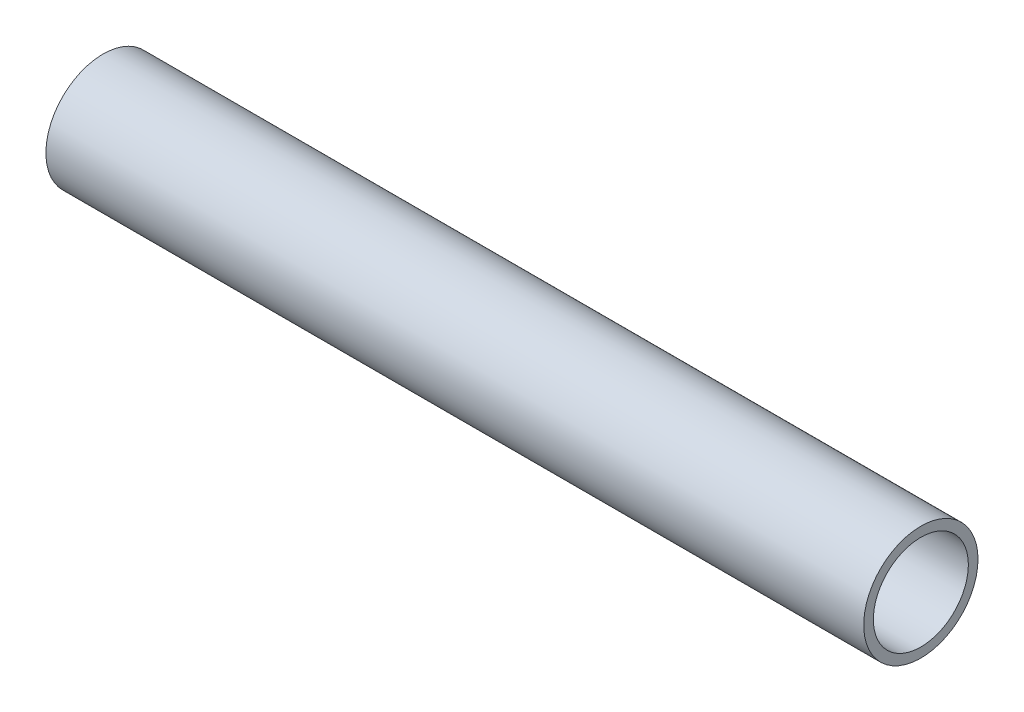
ISO-10303-21;
HEADER;
FILE_DESCRIPTION(('STEP AP214'),'2;1');
FILE_NAME('part.step','',(''),(''),'','','');
FILE_SCHEMA(('AUTOMOTIVE_DESIGN { 1 0 10303 214 1 1 1 1 }'));
ENDSEC;
DATA;
#1=APPLICATION_CONTEXT('core data for automotive mechanical design processes');
#2=APPLICATION_PROTOCOL_DEFINITION('international standard','automotive_design',2000,#1);
#3=PRODUCT_CONTEXT('',#1,'mechanical');
#4=PRODUCT('Part','Part','',(#3));
#5=PRODUCT_RELATED_PRODUCT_CATEGORY('part','',(#4));
#6=PRODUCT_DEFINITION_FORMATION('','',#4);
#7=PRODUCT_DEFINITION_CONTEXT('part definition',#1,'design');
#8=PRODUCT_DEFINITION('design','',#6,#7);
#9=PRODUCT_DEFINITION_SHAPE('','',#8);
#10=(LENGTH_UNIT() NAMED_UNIT(*) SI_UNIT(.MILLI.,.METRE.));
#11=(NAMED_UNIT(*) PLANE_ANGLE_UNIT() SI_UNIT($,.RADIAN.));
#12=(NAMED_UNIT(*) SI_UNIT($,.STERADIAN.) SOLID_ANGLE_UNIT());
#13=UNCERTAINTY_MEASURE_WITH_UNIT(LENGTH_MEASURE(1.E-05),#10,'distance_accuracy_value','');
#14=(GEOMETRIC_REPRESENTATION_CONTEXT(3) GLOBAL_UNCERTAINTY_ASSIGNED_CONTEXT((#13)) GLOBAL_UNIT_ASSIGNED_CONTEXT((#10,
#11,#12)) REPRESENTATION_CONTEXT('',''));
#15=CARTESIAN_POINT('',(0.,0.,0.));
#16=DIRECTION('',(0.,0.,1.));
#17=DIRECTION('',(1.,0.,0.));
#18=AXIS2_PLACEMENT_3D('',#15,#16,#17);
#19=CARTESIAN_POINT('',(-174.625,0.,0.));
#20=DIRECTION('',(1.,0.,0.));
#21=DIRECTION('',(0.,0.,-1.));
#22=AXIS2_PLACEMENT_3D('',#19,#20,#21);
#23=CYLINDRICAL_SURFACE('',#22,21.082);
#24=CARTESIAN_POINT('',(-95.25,0.,-21.082));
#25=CARTESIAN_POINT('',(-95.2500073037573,-0.177265588906064,-21.0819971511082));
#26=CARTESIAN_POINT('',(-95.2648956722781,-0.354633825443564,-21.0797407978607));
#27=CARTESIAN_POINT('',(-95.3240403602155,-0.704412011201185,-21.0709569196678));
#28=CARTESIAN_POINT('',(-95.3683252199961,-0.876816971803983,-21.064425243998));
#29=CARTESIAN_POINT('',(-95.4849091388346,-1.21155604974819,-21.0478246855302));
#30=CARTESIAN_POINT('',(-95.5571869641717,-1.37389769247853,-21.0377584843423));
#31=CARTESIAN_POINT('',(-95.7276530975323,-1.68412370373539,-21.0152009969064));
#32=CARTESIAN_POINT('',(-95.8258378289602,-1.83201006403648,-21.0027100454717));
#33=CARTESIAN_POINT('',(-96.0461542058056,-2.1103164343508,-20.9765819826565));
#34=CARTESIAN_POINT('',(-96.1684495601003,-2.24060616148058,-20.9629374218632));
#35=CARTESIAN_POINT('',(-96.4331633864275,-2.47889671955908,-20.9360982303561));
#36=CARTESIAN_POINT('',(-96.5755830188655,-2.58689626432783,-20.9229036256421));
#37=CARTESIAN_POINT('',(-96.8773786544134,-2.77804840978028,-20.8983859912104));
#38=CARTESIAN_POINT('',(-97.0368354067939,-2.86107486347092,-20.8870725883659));
#39=CARTESIAN_POINT('',(-97.3676295731584,-2.99911783525677,-20.8677000439257));
#40=CARTESIAN_POINT('',(-97.5389663337644,-3.05413589237424,-20.8596407235276));
#41=CARTESIAN_POINT('',(-97.8872863628436,-3.13419550245968,-20.8477621012251));
#42=CARTESIAN_POINT('',(-98.0642172558634,-3.15946016290709,-20.8439112577396));
#43=CARTESIAN_POINT('',(-98.419845943067,-3.17998699422211,-20.8407898425614));
#44=CARTESIAN_POINT('',(-98.5985436343971,-3.17525090142445,-20.8415190057945));
#45=CARTESIAN_POINT('',(-98.9510567099515,-3.13609297404926,-20.8474463775802));
#46=CARTESIAN_POINT('',(-99.1249004248299,-3.101919701057,-20.852607165254));
#47=CARTESIAN_POINT('',(-99.4643579756068,-3.00524659900985,-20.8667578327125));
#48=CARTESIAN_POINT('',(-99.6299715768266,-2.94274596272441,-20.8757478216156));
#49=CARTESIAN_POINT('',(-99.9490235812398,-2.7909340011809,-20.8965852461813));
#50=CARTESIAN_POINT('',(-100.102411162019,-2.70151746318004,-20.9084438587404));
#51=CARTESIAN_POINT('',(-100.392099144084,-2.498486828096,-20.9336742925736));
#52=CARTESIAN_POINT('',(-100.528398414064,-2.38487113028628,-20.9470462139227));
#53=CARTESIAN_POINT('',(-100.781481243325,-2.1353032656861,-20.9739618878806));
#54=CARTESIAN_POINT('',(-100.898054144489,-1.9991374095518,-20.9875060134767));
#55=CARTESIAN_POINT('',(-101.106725455512,-1.70906259522473,-21.0131148002247));
#56=CARTESIAN_POINT('',(-101.198823756631,-1.55515355820368,-21.0251794548033));
#57=CARTESIAN_POINT('',(-101.355942659601,-1.23377816277264,-21.0464826923882));
#58=CARTESIAN_POINT('',(-101.420946926471,-1.06630369822491,-21.0557195696406));
#59=CARTESIAN_POINT('',(-101.521848958346,-0.722645240857131,-21.070312259879));
#60=CARTESIAN_POINT('',(-101.557748707077,-0.546461842495156,-21.0756683373726));
#61=CARTESIAN_POINT('',(-101.599142333219,-0.192204765370484,-21.0818608911754));
#62=CARTESIAN_POINT('',(-101.604925808796,-0.0141656498471117,-21.0827404122035));
#63=CARTESIAN_POINT('',(-101.586691518388,0.340339952440575,-21.0799979514801));
#64=CARTESIAN_POINT('',(-101.562674682621,0.516806488119838,-21.0763761102388));
#65=CARTESIAN_POINT('',(-101.485762333879,0.862279899383912,-21.0650645063623));
#66=CARTESIAN_POINT('',(-101.433007989693,1.03131891039134,-21.0573946347692));
#67=CARTESIAN_POINT('',(-101.300267051749,1.35815274399449,-21.0388441665934));
#68=CARTESIAN_POINT('',(-101.220279170212,1.51594703443953,-21.0279634181826));
#69=CARTESIAN_POINT('',(-101.034662860785,1.8170851157619,-21.0040933283749));
#70=CARTESIAN_POINT('',(-100.928850826916,1.9603145348408,-20.9910891189132));
#71=CARTESIAN_POINT('',(-100.694845351182,2.22708618632573,-20.9644655933992));
#72=CARTESIAN_POINT('',(-100.566650597521,2.35062726403486,-20.9508462413297));
#73=CARTESIAN_POINT('',(-100.290229093112,2.57556977848285,-20.9243908347895));
#74=CARTESIAN_POINT('',(-100.141843493739,2.67677703259561,-20.9115622997957));
#75=CARTESIAN_POINT('',(-99.8300080053974,2.85282903090451,-20.888274456038));
#76=CARTESIAN_POINT('',(-99.6665585261644,2.92767449187153,-20.8778150828597));
#77=CARTESIAN_POINT('',(-99.3298127983176,3.04857772519442,-20.8605043047131));
#78=CARTESIAN_POINT('',(-99.156553855138,3.09473749350593,-20.8536401303661));
#79=CARTESIAN_POINT('',(-98.8046316089195,3.15728352894343,-20.8442630448294));
#80=CARTESIAN_POINT('',(-98.6259686832474,3.17367187018762,-20.8417498305174));
#81=CARTESIAN_POINT('',(-98.2702456638402,3.17616021106898,-20.8413705974415));
#82=CARTESIAN_POINT('',(-98.0931876803551,3.16256554437416,-20.8434577306442));
#83=CARTESIAN_POINT('',(-97.7439067922048,3.10612829026899,-20.8519421795031));
#84=CARTESIAN_POINT('',(-97.5716838795403,3.0632857512491,-20.8583394880282));
#85=CARTESIAN_POINT('',(-97.2370476835853,2.94967717748468,-20.874707044174));
#86=CARTESIAN_POINT('',(-97.0746269537971,2.87893265513937,-20.8846745386426));
#87=CARTESIAN_POINT('',(-96.7639105714977,2.71155871536682,-20.9070627102117));
#88=CARTESIAN_POINT('',(-96.6156154052644,2.61492840724794,-20.9194834717215));
#89=CARTESIAN_POINT('',(-96.3358087193127,2.39741725845485,-20.9455292166376));
#90=CARTESIAN_POINT('',(-96.2044739082908,2.27631033164997,-20.9591647100844));
#91=CARTESIAN_POINT('',(-95.9638828183518,2.01376149306829,-20.9860159394496));
#92=CARTESIAN_POINT('',(-95.8546316769312,1.87231486257537,-20.9992315770924));
#93=CARTESIAN_POINT('',(-95.6607669697578,1.57217776718591,-21.0238378848768));
#94=CARTESIAN_POINT('',(-95.5762935254673,1.41339594518084,-21.0352180180234));
#95=CARTESIAN_POINT('',(-95.4353412780308,1.08380087043067,-21.0547677779054));
#96=CARTESIAN_POINT('',(-95.3788335193363,0.913000272113382,-21.0629407235248));
#97=CARTESIAN_POINT('',(-95.3082168635909,0.61786433248082,-21.0732924950954));
#98=CARTESIAN_POINT('',(-95.2864189599853,0.495349503289427,-21.0765410154751));
#99=CARTESIAN_POINT('',(-95.2573080583054,0.248573261637359,-21.0808957533839));
#100=CARTESIAN_POINT('',(-95.2499948780599,0.124311871162614,-21.0820019978558));
#101=CARTESIAN_POINT('',(-95.25,0.,-21.082));
#102=B_SPLINE_CURVE_WITH_KNOTS('',3,(#24,#25,#26,#27,#28,#29,#30,#31,#32,#33,#34,#35,#36,#37,
#38,#39,#40,#41,#42,#43,#44,#45,#46,#47,#48,#49,#50,#51,#52,#53,#54,#55,#56,#57,#58,#59,#60,#61,
#62,#63,#64,#65,#66,#67,#68,#69,#70,#71,#72,#73,#74,#75,#76,#77,#78,#79,#80,#81,#82,#83,#84,#85,
#86,#87,#88,#89,#90,#91,#92,#93,#94,#95,#96,#97,#98,#99,#100,#101),.UNSPECIFIED.,.T.,.F.,(4,2,2,
2,2,2,2,2,2,2,2,2,2,2,2,2,2,2,2,2,2,2,2,2,2,2,2,2,2,2,2,2,2,2,2,2,2,2,4),(0.,0.531342512429038,
1.06320164882558,1.5946581376531,2.12604129424767,2.66116512439551,3.19631982343617,
3.73413403476704,4.27191869076775,4.80564452954641,5.33933947849273,5.86857170164552,
6.39781900700991,6.92916258470441,7.46054132064733,7.99727852314497,8.53401811031673,
9.07108083107699,9.6081069432693,10.1399593459211,10.6717951472021,11.2010416383702,
11.730313159249,12.2634633412738,12.7966447804,13.3342937698578,13.8719281396386,
14.4076397711918,14.9433140793118,15.4735585288678,16.0038021011393,16.5336376528597,
17.0634914377811,17.5984835709691,18.1336000206727,18.6716867332597,19.2092151415009,
19.5818368843675,19.9544539408189),.UNSPECIFIED.);
#103=CARTESIAN_POINT('',(-95.25,0.,-21.082));
#104=VERTEX_POINT('',#103);
#105=EDGE_CURVE('E84',#104,#104,#102,.T.);
#106=ORIENTED_EDGE('',*,*,#105,.F.);
#107=EDGE_LOOP('',(#106));
#108=FACE_BOUND('',#107,.T.);
#109=CARTESIAN_POINT('',(-146.05,0.,-21.082));
#110=CARTESIAN_POINT('',(-146.050007303757,-0.177265588906064,-21.0819971511082));
#111=CARTESIAN_POINT('',(-146.064895672278,-0.354633825443566,-21.0797407978607));
#112=CARTESIAN_POINT('',(-146.124040360215,-0.704412011201187,-21.0709569196678));
#113=CARTESIAN_POINT('',(-146.168325219996,-0.876816971803985,-21.064425243998));
#114=CARTESIAN_POINT('',(-146.284909138835,-1.21155604974819,-21.0478246855302));
#115=CARTESIAN_POINT('',(-146.357186964172,-1.37389769247854,-21.0377584843423));
#116=CARTESIAN_POINT('',(-146.527653097532,-1.6841237037354,-21.0152009969064));
#117=CARTESIAN_POINT('',(-146.62583782896,-1.8320100640365,-21.0027100454717));
#118=CARTESIAN_POINT('',(-146.846154205806,-2.11031643435081,-20.9765819826565));
#119=CARTESIAN_POINT('',(-146.9684495601,-2.24060616148059,-20.9629374218632));
#120=CARTESIAN_POINT('',(-147.233163386427,-2.47889671955909,-20.9360982303561));
#121=CARTESIAN_POINT('',(-147.375583018865,-2.58689626432784,-20.9229036256421));
#122=CARTESIAN_POINT('',(-147.677378654413,-2.77804840978029,-20.8983859912104));
#123=CARTESIAN_POINT('',(-147.836835406794,-2.86107486347093,-20.8870725883659));
#124=CARTESIAN_POINT('',(-148.167629573158,-2.99911783525678,-20.8677000439257));
#125=CARTESIAN_POINT('',(-148.338966333764,-3.05413589237425,-20.8596407235276));
#126=CARTESIAN_POINT('',(-148.687286362844,-3.13419550245969,-20.8477621012251));
#127=CARTESIAN_POINT('',(-148.864217255863,-3.15946016290709,-20.8439112577396));
#128=CARTESIAN_POINT('',(-149.219845943067,-3.17998699422211,-20.8407898425614));
#129=CARTESIAN_POINT('',(-149.398543634397,-3.17525090142445,-20.8415190057945));
#130=CARTESIAN_POINT('',(-149.751056709951,-3.13609297404926,-20.8474463775802));
#131=CARTESIAN_POINT('',(-149.92490042483,-3.101919701057,-20.852607165254));
#132=CARTESIAN_POINT('',(-150.264357975607,-3.00524659900985,-20.8667578327125));
#133=CARTESIAN_POINT('',(-150.429971576827,-2.9427459627244,-20.8757478216156));
#134=CARTESIAN_POINT('',(-150.74902358124,-2.79093400118089,-20.8965852461813));
#135=CARTESIAN_POINT('',(-150.902411162019,-2.70151746318001,-20.9084438587404));
#136=CARTESIAN_POINT('',(-151.192099144084,-2.49848682809597,-20.9336742925736));
#137=CARTESIAN_POINT('',(-151.328398414064,-2.38487113028625,-20.9470462139227));
#138=CARTESIAN_POINT('',(-151.581481243325,-2.13530326568607,-20.9739618878807));
#139=CARTESIAN_POINT('',(-151.698054144489,-1.99913740955177,-20.9875060134767));
#140=CARTESIAN_POINT('',(-151.906725455512,-1.70906259522471,-21.0131148002247));
#141=CARTESIAN_POINT('',(-151.998823756631,-1.55515355820366,-21.0251794548033));
#142=CARTESIAN_POINT('',(-152.155942659601,-1.23377816277263,-21.0464826923882));
#143=CARTESIAN_POINT('',(-152.220946926471,-1.0663036982249,-21.0557195696406));
#144=CARTESIAN_POINT('',(-152.321848958346,-0.722645240857127,-21.070312259879));
#145=CARTESIAN_POINT('',(-152.357748707077,-0.546461842495151,-21.0756683373726));
#146=CARTESIAN_POINT('',(-152.399142333219,-0.192204765370476,-21.0818608911754));
#147=CARTESIAN_POINT('',(-152.404925808796,-0.014165649847103,-21.0827404122035));
#148=CARTESIAN_POINT('',(-152.386691518388,0.340339952440583,-21.0799979514801));
#149=CARTESIAN_POINT('',(-152.362674682621,0.516806488119846,-21.0763761102388));
#150=CARTESIAN_POINT('',(-152.285762333879,0.86227989938392,-21.0650645063623));
#151=CARTESIAN_POINT('',(-152.233007989693,1.03131891039135,-21.0573946347692));
#152=CARTESIAN_POINT('',(-152.100267051749,1.3581527439945,-21.0388441665934));
#153=CARTESIAN_POINT('',(-152.020279170212,1.51594703443955,-21.0279634181826));
#154=CARTESIAN_POINT('',(-151.834662860785,1.8170851157619,-21.0040933283749));
#155=CARTESIAN_POINT('',(-151.728850826916,1.96031453484078,-20.9910891189132));
#156=CARTESIAN_POINT('',(-151.494845351182,2.22708618632572,-20.9644655933992));
#157=CARTESIAN_POINT('',(-151.366650597521,2.35062726403487,-20.9508462413297));
#158=CARTESIAN_POINT('',(-151.090229093112,2.57556977848286,-20.9243908347895));
#159=CARTESIAN_POINT('',(-150.941843493739,2.67677703259561,-20.9115622997957));
#160=CARTESIAN_POINT('',(-150.630008005397,2.8528290309045,-20.888274456038));
#161=CARTESIAN_POINT('',(-150.466558526164,2.92767449187153,-20.8778150828597));
#162=CARTESIAN_POINT('',(-150.129812798318,3.04857772519442,-20.8605043047131));
#163=CARTESIAN_POINT('',(-149.956553855138,3.09473749350594,-20.8536401303661));
#164=CARTESIAN_POINT('',(-149.604631608919,3.15728352894343,-20.8442630448294));
#165=CARTESIAN_POINT('',(-149.425968683247,3.17367187018762,-20.8417498305174));
#166=CARTESIAN_POINT('',(-149.07024566384,3.17616021106899,-20.8413705974415));
#167=CARTESIAN_POINT('',(-148.893187680355,3.16256554437416,-20.8434577306442));
#168=CARTESIAN_POINT('',(-148.543906792205,3.10612829026899,-20.8519421795031));
#169=CARTESIAN_POINT('',(-148.37168387954,3.0632857512491,-20.8583394880282));
#170=CARTESIAN_POINT('',(-148.037047683585,2.94967717748468,-20.874707044174));
#171=CARTESIAN_POINT('',(-147.874626953797,2.87893265513936,-20.8846745386426));
#172=CARTESIAN_POINT('',(-147.563910571498,2.71155871536682,-20.9070627102117));
#173=CARTESIAN_POINT('',(-147.415615405264,2.61492840724794,-20.9194834717215));
#174=CARTESIAN_POINT('',(-147.135808719313,2.39741725845485,-20.9455292166376));
#175=CARTESIAN_POINT('',(-147.004473908291,2.27631033164997,-20.9591647100844));
#176=CARTESIAN_POINT('',(-146.763882818352,2.01376149306828,-20.9860159394496));
#177=CARTESIAN_POINT('',(-146.654631676931,1.87231486257536,-20.9992315770924));
#178=CARTESIAN_POINT('',(-146.460766969758,1.57217776718591,-21.0238378848768));
#179=CARTESIAN_POINT('',(-146.376293525467,1.41339594518084,-21.0352180180234));
#180=CARTESIAN_POINT('',(-146.235341278031,1.08380087043067,-21.0547677779054));
#181=CARTESIAN_POINT('',(-146.178833519336,0.913000272113373,-21.0629407235248));
#182=CARTESIAN_POINT('',(-146.108216863591,0.617864332480807,-21.0732924950954));
#183=CARTESIAN_POINT('',(-146.086418959985,0.495349503289417,-21.0765410154751));
#184=CARTESIAN_POINT('',(-146.057308058305,0.248573261637354,-21.0808957533839));
#185=CARTESIAN_POINT('',(-146.04999487806,0.124311871162612,-21.0820019978558));
#186=CARTESIAN_POINT('',(-146.05,0.,-21.082));
#187=B_SPLINE_CURVE_WITH_KNOTS('',3,(#109,#110,#111,#112,#113,#114,#115,#116,#117,#118,#119,
#120,#121,#122,#123,#124,#125,#126,#127,#128,#129,#130,#131,#132,#133,#134,#135,#136,#137,#138,
#139,#140,#141,#142,#143,#144,#145,#146,#147,#148,#149,#150,#151,#152,#153,#154,#155,#156,#157,
#158,#159,#160,#161,#162,#163,#164,#165,#166,#167,#168,#169,#170,#171,#172,#173,#174,#175,#176,
#177,#178,#179,#180,#181,#182,#183,#184,#185,#186),.UNSPECIFIED.,.T.,.F.,(4,2,2,2,2,2,2,2,2,2,2,
2,2,2,2,2,2,2,2,2,2,2,2,2,2,2,2,2,2,2,2,2,2,2,2,2,2,2,4),(0.,0.53134251242904,1.06320164882559,
1.59465813765311,2.12604129424768,2.66116512439553,3.19631982343618,3.73413403476707,
4.27191869076778,4.80564452954643,5.33933947849274,5.86857170164554,6.39781900700992,
6.92916258470446,7.46054132064736,7.99727852314501,8.53401811031675,9.071080831077,
9.60810694326931,10.1399593459211,10.6717951472021,11.2010416383702,11.730313159249,
12.2634633412738,12.7966447804,13.3342937698578,13.8719281396386,14.4076397711918,
14.9433140793118,15.4735585288678,16.0038021011393,16.5336376528597,17.0634914377811,
17.5984835709691,18.1336000206728,18.6716867332597,19.2092151415009,19.5818368843675,
19.9544539408189),.UNSPECIFIED.);
#188=CARTESIAN_POINT('',(-146.05,0.,-21.082));
#189=VERTEX_POINT('',#188);
#190=EDGE_CURVE('E65',#189,#189,#187,.T.);
#191=ORIENTED_EDGE('',*,*,#190,.F.);
#192=EDGE_LOOP('',(#191));
#193=FACE_BOUND('',#192,.T.);
#194=CARTESIAN_POINT('',(-174.625,0.,0.));
#195=DIRECTION('',(1.,0.,0.));
#196=DIRECTION('',(0.,0.,-1.));
#197=AXIS2_PLACEMENT_3D('',#194,#195,#196);
#198=CIRCLE('',#197,21.082);
#199=CARTESIAN_POINT('',(-174.625,0.,-21.082));
#200=VERTEX_POINT('',#199);
#201=EDGE_CURVE('E10',#200,#200,#198,.T.);
#202=ORIENTED_EDGE('',*,*,#201,.T.);
#203=EDGE_LOOP('',(#202));
#204=FACE_BOUND('',#203,.T.);
#205=CARTESIAN_POINT('',(127.,0.,0.));
#206=DIRECTION('',(1.,0.,0.));
#207=DIRECTION('',(0.,0.,-1.));
#208=AXIS2_PLACEMENT_3D('',#205,#206,#207);
#209=CIRCLE('',#208,21.082);
#210=CARTESIAN_POINT('',(127.,0.,-21.082));
#211=VERTEX_POINT('',#210);
#212=EDGE_CURVE('E55',#211,#211,#209,.T.);
#213=ORIENTED_EDGE('',*,*,#212,.F.);
#214=EDGE_LOOP('',(#213));
#215=FACE_BOUND('',#214,.T.);
#216=ADVANCED_FACE('F34',(#108,#193,#204,#215),#23,.T.);
#217=CARTESIAN_POINT('',(-174.625,0.,0.));
#218=DIRECTION('',(1.,0.,0.));
#219=DIRECTION('',(0.,0.,-1.));
#220=AXIS2_PLACEMENT_3D('',#217,#218,#219);
#221=PLANE('',#220);
#222=CARTESIAN_POINT('',(-174.625,0.,0.));
#223=DIRECTION('',(1.,0.,0.));
#224=DIRECTION('',(0.,0.,-1.));
#225=AXIS2_PLACEMENT_3D('',#222,#223,#224);
#226=CIRCLE('',#225,17.526);
#227=CARTESIAN_POINT('',(-174.625,0.,-17.526));
#228=VERTEX_POINT('',#227);
#229=EDGE_CURVE('E48',#228,#228,#226,.T.);
#230=ORIENTED_EDGE('',*,*,#229,.T.);
#231=EDGE_LOOP('',(#230));
#232=FACE_BOUND('',#231,.T.);
#233=ORIENTED_EDGE('',*,*,#201,.F.);
#234=EDGE_LOOP('',(#233));
#235=FACE_BOUND('',#234,.T.);
#236=ADVANCED_FACE('F101',(#232,#235),#221,.F.);
#237=CARTESIAN_POINT('',(-174.625,0.,0.));
#238=DIRECTION('',(1.,0.,0.));
#239=DIRECTION('',(0.,0.,-1.));
#240=AXIS2_PLACEMENT_3D('',#237,#238,#239);
#241=CYLINDRICAL_SURFACE('',#240,17.526);
#242=CARTESIAN_POINT('',(-101.6,0.,-17.526));
#243=CARTESIAN_POINT('',(-101.599993132515,0.17679082350801,-17.5259968412274));
#244=CARTESIAN_POINT('',(-101.585183965731,0.353672270747988,-17.5232972774411));
#245=CARTESIAN_POINT('',(-101.526372438004,0.702458155041369,-17.5127883009458));
#246=CARTESIAN_POINT('',(-101.482344740396,0.874358137310072,-17.5049744534986));
#247=CARTESIAN_POINT('',(-101.366482418544,1.20808580036967,-17.485111731742));
#248=CARTESIAN_POINT('',(-101.29467216344,1.36992216434489,-17.4730665697294));
#249=CARTESIAN_POINT('',(-101.125350679922,1.67923272236702,-17.4460593997375));
#250=CARTESIAN_POINT('',(-101.027841801324,1.82670822784651,-17.4310976584752));
#251=CARTESIAN_POINT('',(-100.808729501993,2.10478127681952,-17.3997234174553));
#252=CARTESIAN_POINT('',(-100.686893953305,2.23519445696564,-17.3832978577657));
#253=CARTESIAN_POINT('',(-100.423086238519,2.47384671567764,-17.3509451203049));
#254=CARTESIAN_POINT('',(-100.281112684689,2.58208426483874,-17.3350179769725));
#255=CARTESIAN_POINT('',(-99.97976755925,2.77407084888639,-17.3053386524232));
#256=CARTESIAN_POINT('',(-99.82027574471,2.8576339824516,-17.2916033234658));
#257=CARTESIAN_POINT('',(-99.4892275026837,2.99671002667021,-17.2680459841376));
#258=CARTESIAN_POINT('',(-99.3176720447767,3.05222518866685,-17.2582236596927));
#259=CARTESIAN_POINT('',(-98.9693334205962,3.13304110203761,-17.2437354838221));
#260=CARTESIAN_POINT('',(-98.7926269370351,3.15866238598856,-17.2390149702052));
#261=CARTESIAN_POINT('',(-98.4373650062532,3.17995782064228,-17.235099927382));
#262=CARTESIAN_POINT('',(-98.2588097149559,3.1756344765814,-17.2359049358977));
#263=CARTESIAN_POINT('',(-97.9072300510038,3.13742365897766,-17.2429001682717));
#264=CARTESIAN_POINT('',(-97.7341647086679,3.10389926153133,-17.2490242538492));
#265=CARTESIAN_POINT('',(-97.3961562140921,3.00880912932249,-17.2658638407267));
#266=CARTESIAN_POINT('',(-97.231213386391,2.94724227511612,-17.2765795253205));
#267=CARTESIAN_POINT('',(-96.9130619363625,2.79745571266688,-17.3014647929721));
#268=CARTESIAN_POINT('',(-96.7599245079335,2.7090880872545,-17.3156534578234));
#269=CARTESIAN_POINT('',(-96.470514150003,2.50831315208051,-17.3458731721502));
#270=CARTESIAN_POINT('',(-96.3342428236547,2.39590355985285,-17.3619043964854));
#271=CARTESIAN_POINT('',(-96.0803338962992,2.14827149301383,-17.3942918762038));
#272=CARTESIAN_POINT('',(-95.962999429291,2.01273815664841,-17.4106494468318));
#273=CARTESIAN_POINT('',(-95.7526886211131,1.72374960651158,-17.4416297211863));
#274=CARTESIAN_POINT('',(-95.6597124943575,1.57029423499867,-17.4562524096409));
#275=CARTESIAN_POINT('',(-95.500718396598,1.24951132270804,-17.4821419521182));
#276=CARTESIAN_POINT('',(-95.4347304486683,1.08216858038397,-17.4934050650234));
#277=CARTESIAN_POINT('',(-95.3318843483637,0.738524824278316,-17.5112771866033));
#278=CARTESIAN_POINT('',(-95.2950233103667,0.562224699752744,-17.5178866563105));
#279=CARTESIAN_POINT('',(-95.2518958271967,0.208280155645573,-17.5256438790602));
#280=CARTESIAN_POINT('',(-95.245213792981,0.0306879466818638,-17.5268658171028));
#281=CARTESIAN_POINT('',(-95.2615213711922,-0.323076767936696,-17.5239146703191));
#282=CARTESIAN_POINT('',(-95.2845096264779,-0.499249338156001,-17.5197418322538));
#283=CARTESIAN_POINT('',(-95.3591596423848,-0.843866600411555,-17.5065161011469));
#284=CARTESIAN_POINT('',(-95.4106125479722,-1.01235801735561,-17.4974987676082));
#285=CARTESIAN_POINT('',(-95.5405063595171,-1.33832313012139,-17.4755909179164));
#286=CARTESIAN_POINT('',(-95.6189490011885,-1.49579611656221,-17.4627001526692));
#287=CARTESIAN_POINT('',(-95.8015255027009,-1.7970379428255,-17.4342904171948));
#288=CARTESIAN_POINT('',(-95.9059150975122,-1.94064931955918,-17.4187457992515));
#289=CARTESIAN_POINT('',(-96.1370744185283,-2.20846506883692,-17.3868220571775));
#290=CARTESIAN_POINT('',(-96.2638460863583,-2.33266775593063,-17.3704428607355));
#291=CARTESIAN_POINT('',(-96.5380470534088,-2.55970748627499,-17.3384518393717));
#292=CARTESIAN_POINT('',(-96.6857120955064,-2.66226178053651,-17.3228519867864));
#293=CARTESIAN_POINT('',(-96.9964178334415,-2.84110984177048,-17.2944212278246));
#294=CARTESIAN_POINT('',(-97.1594579820262,-2.91740454296296,-17.2815902229488));
#295=CARTESIAN_POINT('',(-97.4955450343434,-3.04115979533501,-17.2602426012819));
#296=CARTESIAN_POINT('',(-97.6685416025097,-3.08875345587471,-17.2517060985603));
#297=CARTESIAN_POINT('',(-98.0202437321866,-3.15416897697809,-17.2398671271274));
#298=CARTESIAN_POINT('',(-98.1989486950753,-3.17199394891527,-17.2365641114227));
#299=CARTESIAN_POINT('',(-98.5541655418571,-3.17726742876193,-17.2355925385196));
#300=CARTESIAN_POINT('',(-98.7306707384355,-3.16516161695717,-17.2378413124165));
#301=CARTESIAN_POINT('',(-99.0790866320758,-3.11188910689162,-17.2475373034534));
#302=CARTESIAN_POINT('',(-99.2509973523558,-3.07072255551699,-17.2549844943182));
#303=CARTESIAN_POINT('',(-99.5851258972035,-2.96067981082377,-17.2742044563146));
#304=CARTESIAN_POINT('',(-99.7473590229442,-2.89184876708741,-17.2859701767276));
#305=CARTESIAN_POINT('',(-100.058046204287,-2.72847862049299,-17.3125070165183));
#306=CARTESIAN_POINT('',(-100.20649937582,-2.633937869728,-17.3272783285292));
#307=CARTESIAN_POINT('',(-100.487651300551,-2.42026944589855,-17.3584203635157));
#308=CARTESIAN_POINT('',(-100.620100559389,-2.30081626698696,-17.37481057328));
#309=CARTESIAN_POINT('',(-100.86322420719,-2.04139533634304,-17.4071948659678));
#310=CARTESIAN_POINT('',(-100.973893583025,-1.90142287454245,-17.4231888569539));
#311=CARTESIAN_POINT('',(-101.171171023297,-1.60354404533997,-17.4531342301883));
#312=CARTESIAN_POINT('',(-101.257571193469,-1.44549813095465,-17.4670675069251));
#313=CARTESIAN_POINT('',(-101.402456942508,-1.11693687333548,-17.4911451342375));
#314=CARTESIAN_POINT('',(-101.460969245347,-0.946433648982045,-17.5012931100993));
#315=CARTESIAN_POINT('',(-101.536276479759,-0.646146664812306,-17.5145413811557));
#316=CARTESIAN_POINT('',(-101.560132786512,-0.518138865968811,-17.5188145120769));
#317=CARTESIAN_POINT('',(-101.591996893811,-0.26010370060993,-17.5245449517082));
#318=CARTESIAN_POINT('',(-101.600005052851,-0.130076379844328,-17.5260023241122));
#319=CARTESIAN_POINT('',(-101.6,0.,-17.526));
#320=B_SPLINE_CURVE_WITH_KNOTS('',3,(#242,#243,#244,#245,#246,#247,#248,#249,#250,#251,#252,
#253,#254,#255,#256,#257,#258,#259,#260,#261,#262,#263,#264,#265,#266,#267,#268,#269,#270,#271,
#272,#273,#274,#275,#276,#277,#278,#279,#280,#281,#282,#283,#284,#285,#286,#287,#288,#289,#290,
#291,#292,#293,#294,#295,#296,#297,#298,#299,#300,#301,#302,#303,#304,#305,#306,#307,#308,#309,
#310,#311,#312,#313,#314,#315,#316,#317,#318,#319),.UNSPECIFIED.,.T.,.F.,(4,2,2,2,2,2,2,2,2,2,2,
2,2,2,2,2,2,2,2,2,2,2,2,2,2,2,2,2,2,2,2,2,2,2,2,2,2,2,4),(0.,0.52989684739867,1.06025379298761,
1.59014659312776,2.11999095802632,2.65515610450925,3.19035814774705,3.7294952286848,
4.26858902750702,4.80184775131232,5.33506186200683,5.86173930617047,6.38843777693352,
6.91809776769747,7.4478080649945,7.985299753981,8.52279617407827,9.06088891772033,
9.59892834547637,10.1295354893394,10.6601183636945,11.1868588327276,11.713633182854,
12.2458209999474,12.778055006572,13.3168607871052,13.8556473969222,14.3919156166157,
14.9281277829441,15.4564037756751,15.9846770982784,16.5120917356115,17.0395401864443,
17.5743685624972,18.1093198977251,18.6487229234539,19.1876080135939,19.5774960261897,
19.9673752191978),.UNSPECIFIED.);
#321=CARTESIAN_POINT('',(-101.6,0.,-17.526));
#322=VERTEX_POINT('',#321);
#323=EDGE_CURVE('E38',#322,#322,#320,.T.);
#324=ORIENTED_EDGE('',*,*,#323,.T.);
#325=EDGE_LOOP('',(#324));
#326=FACE_BOUND('',#325,.T.);
#327=CARTESIAN_POINT('',(-152.4,0.,-17.526));
#328=CARTESIAN_POINT('',(-152.399993132515,0.176790823508009,-17.5259968412274));
#329=CARTESIAN_POINT('',(-152.385183965731,0.353672270747985,-17.5232972774411));
#330=CARTESIAN_POINT('',(-152.326372438004,0.702458155041367,-17.5127883009458));
#331=CARTESIAN_POINT('',(-152.282344740396,0.874358137310074,-17.5049744534986));
#332=CARTESIAN_POINT('',(-152.166482418544,1.20808580036968,-17.485111731742));
#333=CARTESIAN_POINT('',(-152.09467216344,1.3699221643449,-17.4730665697294));
#334=CARTESIAN_POINT('',(-151.925350679922,1.67923272236704,-17.4460593997375));
#335=CARTESIAN_POINT('',(-151.827841801324,1.82670822784652,-17.4310976584752));
#336=CARTESIAN_POINT('',(-151.608729501993,2.10478127681953,-17.3997234174553));
#337=CARTESIAN_POINT('',(-151.486893953305,2.23519445696565,-17.3832978577657));
#338=CARTESIAN_POINT('',(-151.223086238519,2.47384671567765,-17.3509451203049));
#339=CARTESIAN_POINT('',(-151.081112684689,2.58208426483874,-17.3350179769725));
#340=CARTESIAN_POINT('',(-150.77976755925,2.77407084888639,-17.3053386524232));
#341=CARTESIAN_POINT('',(-150.62027574471,2.8576339824516,-17.2916033234658));
#342=CARTESIAN_POINT('',(-150.289227502684,2.99671002667021,-17.2680459841376));
#343=CARTESIAN_POINT('',(-150.117672044777,3.05222518866685,-17.2582236596927));
#344=CARTESIAN_POINT('',(-149.769333420596,3.13304110203761,-17.2437354838221));
#345=CARTESIAN_POINT('',(-149.592626937035,3.15866238598857,-17.2390149702052));
#346=CARTESIAN_POINT('',(-149.237365006253,3.17995782064228,-17.235099927382));
#347=CARTESIAN_POINT('',(-149.058809714956,3.1756344765814,-17.2359049358977));
#348=CARTESIAN_POINT('',(-148.707230051004,3.13742365897766,-17.2429001682717));
#349=CARTESIAN_POINT('',(-148.534164708668,3.10389926153133,-17.2490242538492));
#350=CARTESIAN_POINT('',(-148.196156214092,3.00880912932248,-17.2658638407267));
#351=CARTESIAN_POINT('',(-148.031213386391,2.94724227511611,-17.2765795253205));
#352=CARTESIAN_POINT('',(-147.713061936362,2.79745571266685,-17.3014647929721));
#353=CARTESIAN_POINT('',(-147.559924507933,2.70908808725447,-17.3156534578234));
#354=CARTESIAN_POINT('',(-147.270514150003,2.50831315208049,-17.3458731721502));
#355=CARTESIAN_POINT('',(-147.134242823655,2.39590355985283,-17.3619043964854));
#356=CARTESIAN_POINT('',(-146.880333896299,2.14827149301382,-17.3942918762038));
#357=CARTESIAN_POINT('',(-146.762999429291,2.01273815664841,-17.4106494468318));
#358=CARTESIAN_POINT('',(-146.552688621113,1.72374960651158,-17.4416297211863));
#359=CARTESIAN_POINT('',(-146.459712494357,1.57029423499867,-17.4562524096409));
#360=CARTESIAN_POINT('',(-146.300718396598,1.24951132270804,-17.4821419521182));
#361=CARTESIAN_POINT('',(-146.234730448668,1.08216858038396,-17.4934050650234));
#362=CARTESIAN_POINT('',(-146.131884348364,0.738524824278307,-17.5112771866033));
#363=CARTESIAN_POINT('',(-146.095023310367,0.562224699752732,-17.5178866563105));
#364=CARTESIAN_POINT('',(-146.051895827197,0.208280155645558,-17.5256438790602));
#365=CARTESIAN_POINT('',(-146.045213792981,0.0306879466818504,-17.5268658171028));
#366=CARTESIAN_POINT('',(-146.061521371192,-0.323076767936705,-17.5239146703191));
#367=CARTESIAN_POINT('',(-146.084509626478,-0.499249338156009,-17.5197418322538));
#368=CARTESIAN_POINT('',(-146.159159642385,-0.843866600411558,-17.5065161011469));
#369=CARTESIAN_POINT('',(-146.210612547972,-1.01235801735561,-17.4974987676082));
#370=CARTESIAN_POINT('',(-146.340506359517,-1.3383231301214,-17.4755909179164));
#371=CARTESIAN_POINT('',(-146.418949001188,-1.49579611656221,-17.4627001526692));
#372=CARTESIAN_POINT('',(-146.601525502701,-1.79703794282551,-17.4342904171948));
#373=CARTESIAN_POINT('',(-146.705915097512,-1.94064931955918,-17.4187457992515));
#374=CARTESIAN_POINT('',(-146.937074418528,-2.20846506883692,-17.3868220571775));
#375=CARTESIAN_POINT('',(-147.063846086358,-2.33266775593063,-17.3704428607355));
#376=CARTESIAN_POINT('',(-147.338047053409,-2.559707486275,-17.3384518393717));
#377=CARTESIAN_POINT('',(-147.485712095506,-2.66226178053653,-17.3228519867864));
#378=CARTESIAN_POINT('',(-147.796417833441,-2.84110984177049,-17.2944212278246));
#379=CARTESIAN_POINT('',(-147.959457982026,-2.91740454296297,-17.2815902229488));
#380=CARTESIAN_POINT('',(-148.295545034343,-3.04115979533501,-17.2602426012819));
#381=CARTESIAN_POINT('',(-148.46854160251,-3.08875345587471,-17.2517060985603));
#382=CARTESIAN_POINT('',(-148.820243732187,-3.1541689769781,-17.2398671271274));
#383=CARTESIAN_POINT('',(-148.998948695075,-3.17199394891528,-17.2365641114227));
#384=CARTESIAN_POINT('',(-149.354165541857,-3.17726742876193,-17.2355925385196));
#385=CARTESIAN_POINT('',(-149.530670738435,-3.16516161695717,-17.2378413124165));
#386=CARTESIAN_POINT('',(-149.879086632076,-3.11188910689162,-17.2475373034534));
#387=CARTESIAN_POINT('',(-150.050997352356,-3.07072255551698,-17.2549844943182));
#388=CARTESIAN_POINT('',(-150.385125897204,-2.96067981082376,-17.2742044563146));
#389=CARTESIAN_POINT('',(-150.547359022944,-2.8918487670874,-17.2859701767276));
#390=CARTESIAN_POINT('',(-150.858046204287,-2.72847862049297,-17.3125070165183));
#391=CARTESIAN_POINT('',(-151.00649937582,-2.63393786972798,-17.3272783285293));
#392=CARTESIAN_POINT('',(-151.287651300551,-2.42026944589853,-17.3584203635157));
#393=CARTESIAN_POINT('',(-151.420100559389,-2.30081626698695,-17.37481057328));
#394=CARTESIAN_POINT('',(-151.66322420719,-2.04139533634303,-17.4071948659678));
#395=CARTESIAN_POINT('',(-151.773893583025,-1.90142287454244,-17.4231888569539));
#396=CARTESIAN_POINT('',(-151.971171023297,-1.60354404533996,-17.4531342301883));
#397=CARTESIAN_POINT('',(-152.057571193469,-1.44549813095464,-17.4670675069251));
#398=CARTESIAN_POINT('',(-152.202456942508,-1.11693687333546,-17.4911451342375));
#399=CARTESIAN_POINT('',(-152.260969245347,-0.946433648982028,-17.5012931100993));
#400=CARTESIAN_POINT('',(-152.336276479759,-0.646146664812287,-17.5145413811557));
#401=CARTESIAN_POINT('',(-152.360132786512,-0.518138865968793,-17.5188145120769));
#402=CARTESIAN_POINT('',(-152.391996893811,-0.260103700609919,-17.5245449517082));
#403=CARTESIAN_POINT('',(-152.400005052851,-0.130076379844322,-17.5260023241122));
#404=CARTESIAN_POINT('',(-152.4,0.,-17.526));
#405=B_SPLINE_CURVE_WITH_KNOTS('',3,(#327,#328,#329,#330,#331,#332,#333,#334,#335,#336,#337,
#338,#339,#340,#341,#342,#343,#344,#345,#346,#347,#348,#349,#350,#351,#352,#353,#354,#355,#356,
#357,#358,#359,#360,#361,#362,#363,#364,#365,#366,#367,#368,#369,#370,#371,#372,#373,#374,#375,
#376,#377,#378,#379,#380,#381,#382,#383,#384,#385,#386,#387,#388,#389,#390,#391,#392,#393,#394,
#395,#396,#397,#398,#399,#400,#401,#402,#403,#404),.UNSPECIFIED.,.T.,.F.,(4,2,2,2,2,2,2,2,2,2,2,
2,2,2,2,2,2,2,2,2,2,2,2,2,2,2,2,2,2,2,2,2,2,2,2,2,2,2,4),(0.,0.52989684739867,1.06025379298762,
1.59014659312777,2.11999095802633,2.65515610450925,3.19035814774706,3.72949522868482,
4.26858902750703,4.80184775131235,5.33506186200683,5.86173930617047,6.3884377769336,
6.91809776769754,7.44780806499452,7.985299753981,8.52279617407827,9.06088891772035,
9.59892834547639,10.1295354893394,10.6601183636946,11.1868588327276,11.713633182854,
12.2458209999474,12.778055006572,13.3168607871052,13.8556473969223,14.3919156166158,
14.9281277829441,15.4564037756751,15.9846770982785,16.5120917356116,17.0395401864443,
17.5743685624972,18.1093198977252,18.648722923454,19.1876080135939,19.5774960261897,
19.9673752191978),.UNSPECIFIED.);
#406=CARTESIAN_POINT('',(-152.4,0.,-17.526));
#407=VERTEX_POINT('',#406);
#408=EDGE_CURVE('E58',#407,#407,#405,.T.);
#409=ORIENTED_EDGE('',*,*,#408,.T.);
#410=EDGE_LOOP('',(#409));
#411=FACE_BOUND('',#410,.T.);
#412=ORIENTED_EDGE('',*,*,#229,.F.);
#413=EDGE_LOOP('',(#412));
#414=FACE_BOUND('',#413,.T.);
#415=CARTESIAN_POINT('',(127.,0.,0.));
#416=DIRECTION('',(1.,0.,0.));
#417=DIRECTION('',(0.,0.,-1.));
#418=AXIS2_PLACEMENT_3D('',#415,#416,#417);
#419=CIRCLE('',#418,17.526);
#420=CARTESIAN_POINT('',(127.,0.,-17.526));
#421=VERTEX_POINT('',#420);
#422=EDGE_CURVE('E91',#421,#421,#419,.T.);
#423=ORIENTED_EDGE('',*,*,#422,.T.);
#424=EDGE_LOOP('',(#423));
#425=FACE_BOUND('',#424,.T.);
#426=ADVANCED_FACE('F66',(#326,#411,#414,#425),#241,.F.);
#427=CARTESIAN_POINT('',(127.,0.,0.));
#428=DIRECTION('',(1.,0.,0.));
#429=DIRECTION('',(0.,0.,-1.));
#430=AXIS2_PLACEMENT_3D('',#427,#428,#429);
#431=PLANE('',#430);
#432=ORIENTED_EDGE('',*,*,#212,.T.);
#433=EDGE_LOOP('',(#432));
#434=FACE_BOUND('',#433,.T.);
#435=ORIENTED_EDGE('',*,*,#422,.F.);
#436=EDGE_LOOP('',(#435));
#437=FACE_BOUND('',#436,.T.);
#438=ADVANCED_FACE('F73',(#434,#437),#431,.T.);
#439=CARTESIAN_POINT('',(-149.225,0.,-21.082));
#440=DIRECTION('',(0.,0.,1.));
#441=DIRECTION('',(1.,0.,0.));
#442=AXIS2_PLACEMENT_3D('',#439,#440,#441);
#443=CYLINDRICAL_SURFACE('',#442,3.17500000000009);
#444=ORIENTED_EDGE('',*,*,#190,.T.);
#445=EDGE_LOOP('',(#444));
#446=FACE_BOUND('',#445,.T.);
#447=ORIENTED_EDGE('',*,*,#408,.F.);
#448=EDGE_LOOP('',(#447));
#449=FACE_BOUND('',#448,.T.);
#450=ADVANCED_FACE('F69',(#446,#449),#443,.F.);
#451=CARTESIAN_POINT('',(-98.4250000000001,0.,-21.082));
#452=DIRECTION('',(0.,0.,1.));
#453=DIRECTION('',(1.,0.,0.));
#454=AXIS2_PLACEMENT_3D('',#451,#452,#453);
#455=CYLINDRICAL_SURFACE('',#454,3.17500000000008);
#456=ORIENTED_EDGE('',*,*,#105,.T.);
#457=EDGE_LOOP('',(#456));
#458=FACE_BOUND('',#457,.T.);
#459=ORIENTED_EDGE('',*,*,#323,.F.);
#460=EDGE_LOOP('',(#459));
#461=FACE_BOUND('',#460,.T.);
#462=ADVANCED_FACE('F72',(#458,#461),#455,.F.);
#463=CLOSED_SHELL('',(#216,#236,#426,#438,#450,#462));
#464=MANIFOLD_SOLID_BREP('B2',#463);
#465=ADVANCED_BREP_SHAPE_REPRESENTATION('',(#18,#464),#14);
#466=SHAPE_DEFINITION_REPRESENTATION(#9,#465);
ENDSEC;
END-ISO-10303-21;
